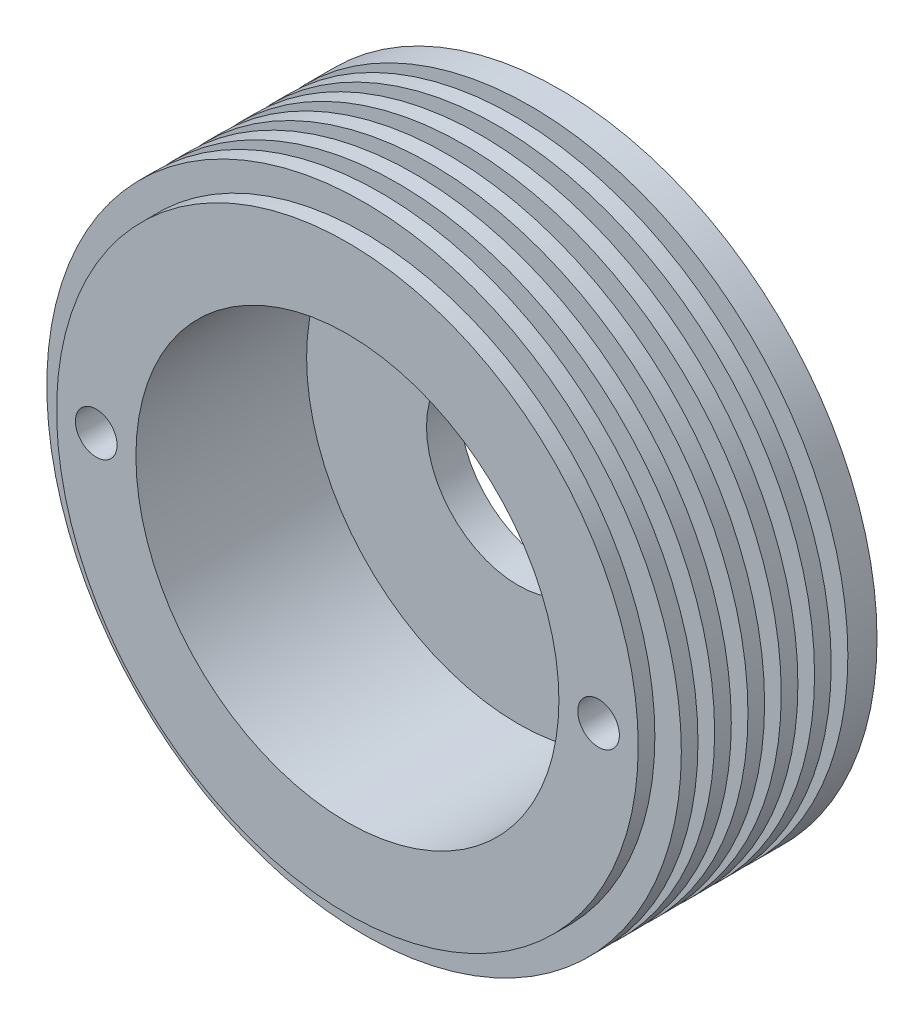
ISO-10303-21;
HEADER;
FILE_DESCRIPTION(('STEP AP214'),'2;1');
FILE_NAME('part.step','',(''),(''),'','','');
FILE_SCHEMA(('AUTOMOTIVE_DESIGN { 1 0 10303 214 1 1 1 1 }'));
ENDSEC;
DATA;
#1=APPLICATION_CONTEXT('core data for automotive mechanical design processes');
#2=APPLICATION_PROTOCOL_DEFINITION('international standard','automotive_design',2000,#1);
#3=PRODUCT_CONTEXT('',#1,'mechanical');
#4=PRODUCT('Part','Part','',(#3));
#5=PRODUCT_RELATED_PRODUCT_CATEGORY('part','',(#4));
#6=PRODUCT_DEFINITION_FORMATION('','',#4);
#7=PRODUCT_DEFINITION_CONTEXT('part definition',#1,'design');
#8=PRODUCT_DEFINITION('design','',#6,#7);
#9=PRODUCT_DEFINITION_SHAPE('','',#8);
#10=(LENGTH_UNIT() NAMED_UNIT(*) SI_UNIT(.MILLI.,.METRE.));
#11=(NAMED_UNIT(*) PLANE_ANGLE_UNIT() SI_UNIT($,.RADIAN.));
#12=(NAMED_UNIT(*) SI_UNIT($,.STERADIAN.) SOLID_ANGLE_UNIT());
#13=UNCERTAINTY_MEASURE_WITH_UNIT(LENGTH_MEASURE(1.E-05),#10,'distance_accuracy_value','');
#14=(GEOMETRIC_REPRESENTATION_CONTEXT(3) GLOBAL_UNCERTAINTY_ASSIGNED_CONTEXT((#13)) GLOBAL_UNIT_ASSIGNED_CONTEXT((#10,
#11,#12)) REPRESENTATION_CONTEXT('',''));
#15=CARTESIAN_POINT('',(0.,0.,0.));
#16=DIRECTION('',(0.,0.,1.));
#17=DIRECTION('',(1.,0.,0.));
#18=AXIS2_PLACEMENT_3D('',#15,#16,#17);
#19=CARTESIAN_POINT('',(23.6795038759268,29.6707036517637,25.5));
#20=DIRECTION('',(0.,0.,-1.));
#21=DIRECTION('',(-1.,0.,0.));
#22=AXIS2_PLACEMENT_3D('',#19,#20,#21);
#23=CYLINDRICAL_SURFACE('',#22,38.1);
#24=CARTESIAN_POINT('',(23.6795038759268,29.6707036517637,0.));
#25=DIRECTION('',(0.,0.,1.));
#26=DIRECTION('',(1.,0.,0.));
#27=AXIS2_PLACEMENT_3D('',#24,#25,#26);
#28=CIRCLE('',#27,38.1);
#29=CARTESIAN_POINT('',(61.7795038759268,29.6707036517637,0.));
#30=VERTEX_POINT('',#29);
#31=EDGE_CURVE('E11',#30,#30,#28,.T.);
#32=ORIENTED_EDGE('',*,*,#31,.T.);
#33=EDGE_LOOP('',(#32));
#34=FACE_BOUND('',#33,.T.);
#35=CARTESIAN_POINT('',(23.6795038759268,29.6707036517637,3.5));
#36=DIRECTION('',(0.,0.,1.));
#37=DIRECTION('',(1.,0.,0.));
#38=AXIS2_PLACEMENT_3D('',#35,#36,#37);
#39=CIRCLE('',#38,38.1);
#40=CARTESIAN_POINT('',(61.7795038759268,29.6707036517637,3.5));
#41=VERTEX_POINT('',#40);
#42=EDGE_CURVE('E88',#41,#41,#39,.T.);
#43=ORIENTED_EDGE('',*,*,#42,.F.);
#44=EDGE_LOOP('',(#43));
#45=FACE_BOUND('',#44,.T.);
#46=ADVANCED_FACE('F39',(#34,#45),#23,.T.);
#47=CARTESIAN_POINT('',(23.6795038759268,29.6707036517637,21.5));
#48=DIRECTION('',(0.,0.,1.));
#49=DIRECTION('',(1.,0.,0.));
#50=AXIS2_PLACEMENT_3D('',#47,#48,#49);
#51=CIRCLE('',#50,38.1);
#52=CARTESIAN_POINT('',(61.7795038759268,29.6707036517637,21.5));
#53=VERTEX_POINT('',#52);
#54=EDGE_CURVE('E150',#53,#53,#51,.T.);
#55=ORIENTED_EDGE('',*,*,#54,.T.);
#56=EDGE_LOOP('',(#55));
#57=FACE_BOUND('',#56,.T.);
#58=CARTESIAN_POINT('',(23.6795038759268,29.6707036517637,23.5));
#59=DIRECTION('',(0.,0.,1.));
#60=DIRECTION('',(1.,0.,0.));
#61=AXIS2_PLACEMENT_3D('',#58,#59,#60);
#62=CIRCLE('',#61,38.1);
#63=CARTESIAN_POINT('',(61.7795038759268,29.6707036517637,23.5));
#64=VERTEX_POINT('',#63);
#65=EDGE_CURVE('E68',#64,#64,#62,.T.);
#66=ORIENTED_EDGE('',*,*,#65,.F.);
#67=EDGE_LOOP('',(#66));
#68=FACE_BOUND('',#67,.T.);
#69=ADVANCED_FACE('F41',(#57,#68),#23,.T.);
#70=CARTESIAN_POINT('',(23.6795038759268,29.6707036517637,25.5));
#71=DIRECTION('',(0.,0.,1.));
#72=DIRECTION('',(1.,0.,0.));
#73=AXIS2_PLACEMENT_3D('',#70,#71,#72);
#74=PLANE('',#73);
#75=CARTESIAN_POINT('',(-6.48299612407322,29.6707036517637,25.5));
#76=DIRECTION('',(0.,0.,-1.));
#77=DIRECTION('',(-1.,0.,0.));
#78=AXIS2_PLACEMENT_3D('',#75,#76,#77);
#79=CIRCLE('',#78,2.5);
#80=CARTESIAN_POINT('',(-8.98299612407322,29.6707036517637,25.5));
#81=VERTEX_POINT('',#80);
#82=EDGE_CURVE('E98',#81,#81,#79,.T.);
#83=ORIENTED_EDGE('',*,*,#82,.T.);
#84=EDGE_LOOP('',(#83));
#85=FACE_BOUND('',#84,.T.);
#86=CARTESIAN_POINT('',(53.8420038759268,29.6707036517639,25.5));
#87=DIRECTION('',(0.,0.,-1.));
#88=DIRECTION('',(-1.,0.,0.));
#89=AXIS2_PLACEMENT_3D('',#86,#87,#88);
#90=CIRCLE('',#89,2.5);
#91=CARTESIAN_POINT('',(51.3420038759268,29.6707036517639,25.5));
#92=VERTEX_POINT('',#91);
#93=EDGE_CURVE('E168',#92,#92,#90,.T.);
#94=ORIENTED_EDGE('',*,*,#93,.T.);
#95=EDGE_LOOP('',(#94));
#96=FACE_BOUND('',#95,.T.);
#97=CARTESIAN_POINT('',(23.6795038759268,29.6707036517637,25.5));
#98=DIRECTION('',(0.,0.,1.));
#99=DIRECTION('',(1.,0.,0.));
#100=AXIS2_PLACEMENT_3D('',#97,#98,#99);
#101=CIRCLE('',#100,25.4);
#102=CARTESIAN_POINT('',(49.0795038759268,29.6707036517637,25.5));
#103=VERTEX_POINT('',#102);
#104=EDGE_CURVE('E53',#103,#103,#101,.T.);
#105=ORIENTED_EDGE('',*,*,#104,.F.);
#106=EDGE_LOOP('',(#105));
#107=FACE_BOUND('',#106,.T.);
#108=CARTESIAN_POINT('',(23.6795038759268,29.6707036517637,25.5));
#109=DIRECTION('',(0.,0.,1.));
#110=DIRECTION('',(1.,0.,0.));
#111=AXIS2_PLACEMENT_3D('',#108,#109,#110);
#112=CIRCLE('',#111,34.925);
#113=CARTESIAN_POINT('',(58.6045038759268,29.6707036517637,25.5));
#114=VERTEX_POINT('',#113);
#115=EDGE_CURVE('E76',#114,#114,#112,.T.);
#116=ORIENTED_EDGE('',*,*,#115,.T.);
#117=EDGE_LOOP('',(#116));
#118=FACE_BOUND('',#117,.T.);
#119=ADVANCED_FACE('F180',(#85,#96,#107,#118),#74,.T.);
#120=CARTESIAN_POINT('',(23.6795038759268,29.6707036517637,36.1126983722081));
#121=DIRECTION('',(0.,0.,-1.));
#122=DIRECTION('',(-1.,0.,0.));
#123=AXIS2_PLACEMENT_3D('',#120,#121,#122);
#124=CYLINDRICAL_SURFACE('',#123,11.);
#125=CARTESIAN_POINT('',(23.6795038759268,29.6707036517637,5.));
#126=DIRECTION('',(0.,0.,1.));
#127=DIRECTION('',(1.,0.,0.));
#128=AXIS2_PLACEMENT_3D('',#125,#126,#127);
#129=CIRCLE('',#128,11.);
#130=CARTESIAN_POINT('',(34.6795038759268,29.6707036517637,5.));
#131=VERTEX_POINT('',#130);
#132=EDGE_CURVE('E59',#131,#131,#129,.F.);
#133=ORIENTED_EDGE('',*,*,#132,.F.);
#134=EDGE_LOOP('',(#133));
#135=FACE_BOUND('',#134,.T.);
#136=CARTESIAN_POINT('',(23.6795038759268,29.6707036517637,1.));
#137=DIRECTION('',(0.,0.,-1.));
#138=DIRECTION('',(-1.,0.,0.));
#139=AXIS2_PLACEMENT_3D('',#136,#137,#138);
#140=CIRCLE('',#139,11.);
#141=CARTESIAN_POINT('',(12.6795038759268,29.6707036517637,1.));
#142=VERTEX_POINT('',#141);
#143=EDGE_CURVE('E43',#142,#142,#140,.F.);
#144=ORIENTED_EDGE('',*,*,#143,.F.);
#145=EDGE_LOOP('',(#144));
#146=FACE_BOUND('',#145,.T.);
#147=ADVANCED_FACE('F194',(#135,#146),#124,.F.);
#148=CARTESIAN_POINT('',(23.6795038759268,29.6707036517637,0.));
#149=DIRECTION('',(0.,0.,1.));
#150=DIRECTION('',(1.,0.,0.));
#151=AXIS2_PLACEMENT_3D('',#148,#149,#150);
#152=PLANE('',#151);
#153=CARTESIAN_POINT('',(-6.48299612407322,29.6707036517637,0.));
#154=DIRECTION('',(0.,0.,-1.));
#155=DIRECTION('',(-1.,0.,0.));
#156=AXIS2_PLACEMENT_3D('',#153,#154,#155);
#157=CIRCLE('',#156,2.5);
#158=CARTESIAN_POINT('',(-8.98299612407322,29.6707036517637,0.));
#159=VERTEX_POINT('',#158);
#160=EDGE_CURVE('E172',#159,#159,#157,.T.);
#161=ORIENTED_EDGE('',*,*,#160,.F.);
#162=EDGE_LOOP('',(#161));
#163=FACE_BOUND('',#162,.T.);
#164=CARTESIAN_POINT('',(53.8420038759268,29.6707036517639,0.));
#165=DIRECTION('',(0.,0.,-1.));
#166=DIRECTION('',(-1.,0.,0.));
#167=AXIS2_PLACEMENT_3D('',#164,#165,#166);
#168=CIRCLE('',#167,2.5);
#169=CARTESIAN_POINT('',(51.3420038759268,29.6707036517639,0.));
#170=VERTEX_POINT('',#169);
#171=EDGE_CURVE('E164',#170,#170,#168,.T.);
#172=ORIENTED_EDGE('',*,*,#171,.F.);
#173=EDGE_LOOP('',(#172));
#174=FACE_BOUND('',#173,.T.);
#175=CARTESIAN_POINT('',(23.6795038759268,29.6707036517637,0.));
#176=DIRECTION('',(0.,0.,-1.));
#177=DIRECTION('',(-1.,0.,0.));
#178=AXIS2_PLACEMENT_3D('',#175,#176,#177);
#179=CIRCLE('',#178,12.7);
#180=CARTESIAN_POINT('',(10.9795038759268,29.6707036517637,0.));
#181=VERTEX_POINT('',#180);
#182=EDGE_CURVE('E63',#181,#181,#179,.T.);
#183=ORIENTED_EDGE('',*,*,#182,.F.);
#184=EDGE_LOOP('',(#183));
#185=FACE_BOUND('',#184,.T.);
#186=ORIENTED_EDGE('',*,*,#31,.F.);
#187=EDGE_LOOP('',(#186));
#188=FACE_BOUND('',#187,.T.);
#189=ADVANCED_FACE('F190',(#163,#174,#185,#188),#152,.F.);
#190=CARTESIAN_POINT('',(23.6795038759268,29.6707036517637,-71.8420489685532));
#191=DIRECTION('',(0.,0.,1.));
#192=DIRECTION('',(1.,0.,0.));
#193=AXIS2_PLACEMENT_3D('',#190,#191,#192);
#194=CYLINDRICAL_SURFACE('',#193,25.4);
#195=CARTESIAN_POINT('',(23.6795038759268,29.6707036517637,5.));
#196=DIRECTION('',(0.,0.,1.));
#197=DIRECTION('',(1.,0.,0.));
#198=AXIS2_PLACEMENT_3D('',#195,#196,#197);
#199=CIRCLE('',#198,25.4);
#200=CARTESIAN_POINT('',(49.0795038759268,29.6707036517637,5.));
#201=VERTEX_POINT('',#200);
#202=EDGE_CURVE('E48',#201,#201,#199,.F.);
#203=ORIENTED_EDGE('',*,*,#202,.T.);
#204=EDGE_LOOP('',(#203));
#205=FACE_BOUND('',#204,.T.);
#206=ORIENTED_EDGE('',*,*,#104,.T.);
#207=EDGE_LOOP('',(#206));
#208=FACE_BOUND('',#207,.T.);
#209=ADVANCED_FACE('F193',(#205,#208),#194,.F.);
#210=CARTESIAN_POINT('',(23.6795038759268,29.6707036517637,5.));
#211=DIRECTION('',(0.,0.,1.));
#212=DIRECTION('',(1.,0.,0.));
#213=AXIS2_PLACEMENT_3D('',#210,#211,#212);
#214=PLANE('',#213);
#215=ORIENTED_EDGE('',*,*,#132,.T.);
#216=EDGE_LOOP('',(#215));
#217=FACE_BOUND('',#216,.T.);
#218=ORIENTED_EDGE('',*,*,#202,.F.);
#219=EDGE_LOOP('',(#218));
#220=FACE_BOUND('',#219,.T.);
#221=ADVANCED_FACE('F213',(#217,#220),#214,.T.);
#222=CARTESIAN_POINT('',(23.6795038759268,29.6707036517637,1.));
#223=DIRECTION('',(0.,0.,-1.));
#224=DIRECTION('',(-1.,0.,0.));
#225=AXIS2_PLACEMENT_3D('',#222,#223,#224);
#226=PLANE('',#225);
#227=CARTESIAN_POINT('',(23.6795038759268,29.6707036517637,1.));
#228=DIRECTION('',(0.,0.,-1.));
#229=DIRECTION('',(-1.,0.,0.));
#230=AXIS2_PLACEMENT_3D('',#227,#228,#229);
#231=CIRCLE('',#230,12.7);
#232=CARTESIAN_POINT('',(10.9795038759268,29.6707036517637,1.));
#233=VERTEX_POINT('',#232);
#234=EDGE_CURVE('E67',#233,#233,#231,.T.);
#235=ORIENTED_EDGE('',*,*,#234,.T.);
#236=EDGE_LOOP('',(#235));
#237=FACE_BOUND('',#236,.T.);
#238=ORIENTED_EDGE('',*,*,#143,.T.);
#239=EDGE_LOOP('',(#238));
#240=FACE_BOUND('',#239,.T.);
#241=ADVANCED_FACE('F203',(#237,#240),#226,.T.);
#242=CARTESIAN_POINT('',(23.6795038759268,29.6707036517637,1.));
#243=DIRECTION('',(0.,0.,-1.));
#244=DIRECTION('',(-1.,0.,0.));
#245=AXIS2_PLACEMENT_3D('',#242,#243,#244);
#246=CYLINDRICAL_SURFACE('',#245,12.7);
#247=ORIENTED_EDGE('',*,*,#234,.F.);
#248=EDGE_LOOP('',(#247));
#249=FACE_BOUND('',#248,.T.);
#250=ORIENTED_EDGE('',*,*,#182,.T.);
#251=EDGE_LOOP('',(#250));
#252=FACE_BOUND('',#251,.T.);
#253=ADVANCED_FACE('F200',(#249,#252),#246,.F.);
#254=CARTESIAN_POINT('',(23.6795038759268,29.6707036517637,23.5));
#255=DIRECTION('',(0.,0.,1.));
#256=DIRECTION('',(1.,0.,0.));
#257=AXIS2_PLACEMENT_3D('',#254,#255,#256);
#258=PLANE('',#257);
#259=CARTESIAN_POINT('',(23.6795038759268,29.6707036517637,23.5));
#260=DIRECTION('',(0.,0.,1.));
#261=DIRECTION('',(1.,0.,0.));
#262=AXIS2_PLACEMENT_3D('',#259,#260,#261);
#263=CIRCLE('',#262,34.925);
#264=CARTESIAN_POINT('',(58.6045038759268,29.6707036517637,23.5));
#265=VERTEX_POINT('',#264);
#266=EDGE_CURVE('E75',#265,#265,#263,.T.);
#267=ORIENTED_EDGE('',*,*,#266,.F.);
#268=EDGE_LOOP('',(#267));
#269=FACE_BOUND('',#268,.T.);
#270=ORIENTED_EDGE('',*,*,#65,.T.);
#271=EDGE_LOOP('',(#270));
#272=FACE_BOUND('',#271,.T.);
#273=ADVANCED_FACE('F202',(#269,#272),#258,.T.);
#274=CARTESIAN_POINT('',(23.6795038759268,29.6707036517637,23.5));
#275=DIRECTION('',(0.,0.,1.));
#276=DIRECTION('',(1.,0.,0.));
#277=AXIS2_PLACEMENT_3D('',#274,#275,#276);
#278=CYLINDRICAL_SURFACE('',#277,34.925);
#279=ORIENTED_EDGE('',*,*,#266,.T.);
#280=EDGE_LOOP('',(#279));
#281=FACE_BOUND('',#280,.T.);
#282=ORIENTED_EDGE('',*,*,#115,.F.);
#283=EDGE_LOOP('',(#282));
#284=FACE_BOUND('',#283,.T.);
#285=ADVANCED_FACE('F210',(#281,#284),#278,.T.);
#286=CARTESIAN_POINT('',(23.6795038759268,29.6707036517637,3.5));
#287=DIRECTION('',(0.,0.,1.));
#288=DIRECTION('',(1.,0.,0.));
#289=AXIS2_PLACEMENT_3D('',#286,#287,#288);
#290=PLANE('',#289);
#291=CARTESIAN_POINT('',(23.6795038759268,29.6707036517637,3.5));
#292=DIRECTION('',(0.,0.,1.));
#293=DIRECTION('',(1.,0.,0.));
#294=AXIS2_PLACEMENT_3D('',#291,#292,#293);
#295=CIRCLE('',#294,34.925);
#296=CARTESIAN_POINT('',(58.6045038759268,29.6707036517637,3.5));
#297=VERTEX_POINT('',#296);
#298=EDGE_CURVE('E89',#297,#297,#295,.T.);
#299=ORIENTED_EDGE('',*,*,#298,.F.);
#300=EDGE_LOOP('',(#299));
#301=FACE_BOUND('',#300,.T.);
#302=ORIENTED_EDGE('',*,*,#42,.T.);
#303=EDGE_LOOP('',(#302));
#304=FACE_BOUND('',#303,.T.);
#305=ADVANCED_FACE('F286',(#301,#304),#290,.T.);
#306=CARTESIAN_POINT('',(23.6795038759268,29.6707036517637,5.5));
#307=DIRECTION('',(0.,0.,1.));
#308=DIRECTION('',(1.,0.,0.));
#309=AXIS2_PLACEMENT_3D('',#306,#307,#308);
#310=PLANE('',#309);
#311=CARTESIAN_POINT('',(23.6795038759268,29.6707036517637,5.5));
#312=DIRECTION('',(0.,0.,1.));
#313=DIRECTION('',(1.,0.,0.));
#314=AXIS2_PLACEMENT_3D('',#311,#312,#313);
#315=CIRCLE('',#314,34.925);
#316=CARTESIAN_POINT('',(58.6045038759268,29.6707036517637,5.5));
#317=VERTEX_POINT('',#316);
#318=EDGE_CURVE('E94',#317,#317,#315,.T.);
#319=ORIENTED_EDGE('',*,*,#318,.T.);
#320=EDGE_LOOP('',(#319));
#321=FACE_BOUND('',#320,.T.);
#322=CARTESIAN_POINT('',(23.6795038759268,29.6707036517637,5.5));
#323=DIRECTION('',(0.,0.,1.));
#324=DIRECTION('',(1.,0.,0.));
#325=AXIS2_PLACEMENT_3D('',#322,#323,#324);
#326=CIRCLE('',#325,38.1);
#327=CARTESIAN_POINT('',(61.7795038759268,29.6707036517637,5.5));
#328=VERTEX_POINT('',#327);
#329=EDGE_CURVE('E84',#328,#328,#326,.T.);
#330=ORIENTED_EDGE('',*,*,#329,.F.);
#331=EDGE_LOOP('',(#330));
#332=FACE_BOUND('',#331,.T.);
#333=ADVANCED_FACE('F284',(#321,#332),#310,.F.);
#334=CARTESIAN_POINT('',(23.6795038759268,29.6707036517637,3.5));
#335=DIRECTION('',(0.,0.,1.));
#336=DIRECTION('',(1.,0.,0.));
#337=AXIS2_PLACEMENT_3D('',#334,#335,#336);
#338=CYLINDRICAL_SURFACE('',#337,34.925);
#339=ORIENTED_EDGE('',*,*,#298,.T.);
#340=EDGE_LOOP('',(#339));
#341=FACE_BOUND('',#340,.T.);
#342=ORIENTED_EDGE('',*,*,#318,.F.);
#343=EDGE_LOOP('',(#342));
#344=FACE_BOUND('',#343,.T.);
#345=ADVANCED_FACE('F280',(#341,#344),#338,.T.);
#346=CARTESIAN_POINT('',(23.6795038759268,29.6707036517637,19.5));
#347=DIRECTION('',(0.,0.,1.));
#348=DIRECTION('',(1.,0.,0.));
#349=AXIS2_PLACEMENT_3D('',#346,#347,#348);
#350=PLANE('',#349);
#351=CARTESIAN_POINT('',(23.6795038759268,29.6707036517637,19.5));
#352=DIRECTION('',(0.,0.,1.));
#353=DIRECTION('',(1.,0.,0.));
#354=AXIS2_PLACEMENT_3D('',#351,#352,#353);
#355=CIRCLE('',#354,34.925);
#356=CARTESIAN_POINT('',(58.6045038759268,29.6707036517637,19.5));
#357=VERTEX_POINT('',#356);
#358=EDGE_CURVE('E154',#357,#357,#355,.T.);
#359=ORIENTED_EDGE('',*,*,#358,.F.);
#360=EDGE_LOOP('',(#359));
#361=FACE_BOUND('',#360,.T.);
#362=CARTESIAN_POINT('',(23.6795038759268,29.6707036517637,19.5));
#363=DIRECTION('',(0.,0.,1.));
#364=DIRECTION('',(1.,0.,0.));
#365=AXIS2_PLACEMENT_3D('',#362,#363,#364);
#366=CIRCLE('',#365,38.1);
#367=CARTESIAN_POINT('',(61.7795038759268,29.6707036517637,19.5));
#368=VERTEX_POINT('',#367);
#369=EDGE_CURVE('E80',#368,#368,#366,.T.);
#370=ORIENTED_EDGE('',*,*,#369,.T.);
#371=EDGE_LOOP('',(#370));
#372=FACE_BOUND('',#371,.T.);
#373=ADVANCED_FACE('F283',(#361,#372),#350,.T.);
#374=CARTESIAN_POINT('',(23.6795038759268,29.6707036517637,21.5));
#375=DIRECTION('',(0.,0.,1.));
#376=DIRECTION('',(1.,0.,0.));
#377=AXIS2_PLACEMENT_3D('',#374,#375,#376);
#378=PLANE('',#377);
#379=CARTESIAN_POINT('',(23.6795038759268,29.6707036517637,21.5));
#380=DIRECTION('',(0.,0.,1.));
#381=DIRECTION('',(1.,0.,0.));
#382=AXIS2_PLACEMENT_3D('',#379,#380,#381);
#383=CIRCLE('',#382,34.925);
#384=CARTESIAN_POINT('',(58.6045038759268,29.6707036517637,21.5));
#385=VERTEX_POINT('',#384);
#386=EDGE_CURVE('E143',#385,#385,#383,.T.);
#387=ORIENTED_EDGE('',*,*,#386,.T.);
#388=EDGE_LOOP('',(#387));
#389=FACE_BOUND('',#388,.T.);
#390=ORIENTED_EDGE('',*,*,#54,.F.);
#391=EDGE_LOOP('',(#390));
#392=FACE_BOUND('',#391,.T.);
#393=ADVANCED_FACE('F238',(#389,#392),#378,.F.);
#394=CARTESIAN_POINT('',(23.6795038759268,29.6707036517637,19.5));
#395=DIRECTION('',(0.,0.,1.));
#396=DIRECTION('',(1.,0.,0.));
#397=AXIS2_PLACEMENT_3D('',#394,#395,#396);
#398=CYLINDRICAL_SURFACE('',#397,34.925);
#399=ORIENTED_EDGE('',*,*,#358,.T.);
#400=EDGE_LOOP('',(#399));
#401=FACE_BOUND('',#400,.T.);
#402=ORIENTED_EDGE('',*,*,#386,.F.);
#403=EDGE_LOOP('',(#402));
#404=FACE_BOUND('',#403,.T.);
#405=ADVANCED_FACE('F228',(#401,#404),#398,.T.);
#406=ORIENTED_EDGE('',*,*,#329,.T.);
#407=EDGE_LOOP('',(#406));
#408=FACE_BOUND('',#407,.T.);
#409=CARTESIAN_POINT('',(23.6795038759268,29.6707036517637,7.5));
#410=DIRECTION('',(0.,0.,1.));
#411=DIRECTION('',(1.,0.,0.));
#412=AXIS2_PLACEMENT_3D('',#409,#410,#411);
#413=CIRCLE('',#412,38.1);
#414=CARTESIAN_POINT('',(61.7795038759268,29.6707036517637,7.5));
#415=VERTEX_POINT('',#414);
#416=EDGE_CURVE('E106',#415,#415,#413,.T.);
#417=ORIENTED_EDGE('',*,*,#416,.F.);
#418=EDGE_LOOP('',(#417));
#419=FACE_BOUND('',#418,.T.);
#420=ADVANCED_FACE('F219',(#408,#419),#23,.T.);
#421=CARTESIAN_POINT('',(23.6795038759268,29.6707036517637,7.5));
#422=DIRECTION('',(0.,0.,1.));
#423=DIRECTION('',(1.,0.,0.));
#424=AXIS2_PLACEMENT_3D('',#421,#422,#423);
#425=PLANE('',#424);
#426=CARTESIAN_POINT('',(23.6795038759268,29.6707036517637,7.5));
#427=DIRECTION('',(0.,0.,1.));
#428=DIRECTION('',(1.,0.,0.));
#429=AXIS2_PLACEMENT_3D('',#426,#427,#428);
#430=CIRCLE('',#429,34.925);
#431=CARTESIAN_POINT('',(58.6045038759268,29.6707036517637,7.5));
#432=VERTEX_POINT('',#431);
#433=EDGE_CURVE('E107',#432,#432,#430,.T.);
#434=ORIENTED_EDGE('',*,*,#433,.F.);
#435=EDGE_LOOP('',(#434));
#436=FACE_BOUND('',#435,.T.);
#437=ORIENTED_EDGE('',*,*,#416,.T.);
#438=EDGE_LOOP('',(#437));
#439=FACE_BOUND('',#438,.T.);
#440=ADVANCED_FACE('F227',(#436,#439),#425,.T.);
#441=CARTESIAN_POINT('',(23.6795038759268,29.6707036517637,9.5));
#442=DIRECTION('',(0.,0.,1.));
#443=DIRECTION('',(1.,0.,0.));
#444=AXIS2_PLACEMENT_3D('',#441,#442,#443);
#445=PLANE('',#444);
#446=CARTESIAN_POINT('',(23.6795038759268,29.6707036517637,9.5));
#447=DIRECTION('',(0.,0.,1.));
#448=DIRECTION('',(1.,0.,0.));
#449=AXIS2_PLACEMENT_3D('',#446,#447,#448);
#450=CIRCLE('',#449,34.925);
#451=CARTESIAN_POINT('',(58.6045038759268,29.6707036517637,9.5));
#452=VERTEX_POINT('',#451);
#453=EDGE_CURVE('E93',#452,#452,#450,.T.);
#454=ORIENTED_EDGE('',*,*,#453,.T.);
#455=EDGE_LOOP('',(#454));
#456=FACE_BOUND('',#455,.T.);
#457=CARTESIAN_POINT('',(23.6795038759268,29.6707036517637,9.5));
#458=DIRECTION('',(0.,0.,1.));
#459=DIRECTION('',(1.,0.,0.));
#460=AXIS2_PLACEMENT_3D('',#457,#458,#459);
#461=CIRCLE('',#460,38.1);
#462=CARTESIAN_POINT('',(61.7795038759268,29.6707036517637,9.5));
#463=VERTEX_POINT('',#462);
#464=EDGE_CURVE('E102',#463,#463,#461,.T.);
#465=ORIENTED_EDGE('',*,*,#464,.F.);
#466=EDGE_LOOP('',(#465));
#467=FACE_BOUND('',#466,.T.);
#468=ADVANCED_FACE('F235',(#456,#467),#445,.F.);
#469=CARTESIAN_POINT('',(23.6795038759268,29.6707036517637,7.5));
#470=DIRECTION('',(0.,0.,1.));
#471=DIRECTION('',(1.,0.,0.));
#472=AXIS2_PLACEMENT_3D('',#469,#470,#471);
#473=CYLINDRICAL_SURFACE('',#472,34.925);
#474=ORIENTED_EDGE('',*,*,#433,.T.);
#475=EDGE_LOOP('',(#474));
#476=FACE_BOUND('',#475,.T.);
#477=ORIENTED_EDGE('',*,*,#453,.F.);
#478=EDGE_LOOP('',(#477));
#479=FACE_BOUND('',#478,.T.);
#480=ADVANCED_FACE('F273',(#476,#479),#473,.T.);
#481=CARTESIAN_POINT('',(23.6795038759268,29.6707036517637,17.5));
#482=DIRECTION('',(0.,0.,1.));
#483=DIRECTION('',(1.,0.,0.));
#484=AXIS2_PLACEMENT_3D('',#481,#482,#483);
#485=CIRCLE('',#484,38.1);
#486=CARTESIAN_POINT('',(61.7795038759268,29.6707036517637,17.5));
#487=VERTEX_POINT('',#486);
#488=EDGE_CURVE('E134',#487,#487,#485,.T.);
#489=ORIENTED_EDGE('',*,*,#488,.T.);
#490=EDGE_LOOP('',(#489));
#491=FACE_BOUND('',#490,.T.);
#492=ORIENTED_EDGE('',*,*,#369,.F.);
#493=EDGE_LOOP('',(#492));
#494=FACE_BOUND('',#493,.T.);
#495=ADVANCED_FACE('F224',(#491,#494),#23,.T.);
#496=CARTESIAN_POINT('',(23.6795038759268,29.6707036517637,15.5));
#497=DIRECTION('',(0.,0.,1.));
#498=DIRECTION('',(1.,0.,0.));
#499=AXIS2_PLACEMENT_3D('',#496,#497,#498);
#500=PLANE('',#499);
#501=CARTESIAN_POINT('',(23.6795038759268,29.6707036517637,15.5));
#502=DIRECTION('',(0.,0.,1.));
#503=DIRECTION('',(1.,0.,0.));
#504=AXIS2_PLACEMENT_3D('',#501,#502,#503);
#505=CIRCLE('',#504,34.925);
#506=CARTESIAN_POINT('',(58.6045038759268,29.6707036517637,15.5));
#507=VERTEX_POINT('',#506);
#508=EDGE_CURVE('E139',#507,#507,#505,.T.);
#509=ORIENTED_EDGE('',*,*,#508,.F.);
#510=EDGE_LOOP('',(#509));
#511=FACE_BOUND('',#510,.T.);
#512=CARTESIAN_POINT('',(23.6795038759268,29.6707036517637,15.5));
#513=DIRECTION('',(0.,0.,1.));
#514=DIRECTION('',(1.,0.,0.));
#515=AXIS2_PLACEMENT_3D('',#512,#513,#514);
#516=CIRCLE('',#515,38.1);
#517=CARTESIAN_POINT('',(61.7795038759268,29.6707036517637,15.5));
#518=VERTEX_POINT('',#517);
#519=EDGE_CURVE('E138',#518,#518,#516,.T.);
#520=ORIENTED_EDGE('',*,*,#519,.T.);
#521=EDGE_LOOP('',(#520));
#522=FACE_BOUND('',#521,.T.);
#523=ADVANCED_FACE('F435',(#511,#522),#500,.T.);
#524=CARTESIAN_POINT('',(23.6795038759268,29.6707036517637,17.5));
#525=DIRECTION('',(0.,0.,1.));
#526=DIRECTION('',(1.,0.,0.));
#527=AXIS2_PLACEMENT_3D('',#524,#525,#526);
#528=PLANE('',#527);
#529=CARTESIAN_POINT('',(23.6795038759268,29.6707036517637,17.5));
#530=DIRECTION('',(0.,0.,1.));
#531=DIRECTION('',(1.,0.,0.));
#532=AXIS2_PLACEMENT_3D('',#529,#530,#531);
#533=CIRCLE('',#532,34.925);
#534=CARTESIAN_POINT('',(58.6045038759268,29.6707036517637,17.5));
#535=VERTEX_POINT('',#534);
#536=EDGE_CURVE('E127',#535,#535,#533,.T.);
#537=ORIENTED_EDGE('',*,*,#536,.T.);
#538=EDGE_LOOP('',(#537));
#539=FACE_BOUND('',#538,.T.);
#540=ORIENTED_EDGE('',*,*,#488,.F.);
#541=EDGE_LOOP('',(#540));
#542=FACE_BOUND('',#541,.T.);
#543=ADVANCED_FACE('F252',(#539,#542),#528,.F.);
#544=CARTESIAN_POINT('',(23.6795038759268,29.6707036517637,15.5));
#545=DIRECTION('',(0.,0.,1.));
#546=DIRECTION('',(1.,0.,0.));
#547=AXIS2_PLACEMENT_3D('',#544,#545,#546);
#548=CYLINDRICAL_SURFACE('',#547,34.925);
#549=ORIENTED_EDGE('',*,*,#508,.T.);
#550=EDGE_LOOP('',(#549));
#551=FACE_BOUND('',#550,.T.);
#552=ORIENTED_EDGE('',*,*,#536,.F.);
#553=EDGE_LOOP('',(#552));
#554=FACE_BOUND('',#553,.T.);
#555=ADVANCED_FACE('F244',(#551,#554),#548,.T.);
#556=ORIENTED_EDGE('',*,*,#464,.T.);
#557=EDGE_LOOP('',(#556));
#558=FACE_BOUND('',#557,.T.);
#559=CARTESIAN_POINT('',(23.6795038759268,29.6707036517637,11.5));
#560=DIRECTION('',(0.,0.,1.));
#561=DIRECTION('',(1.,0.,0.));
#562=AXIS2_PLACEMENT_3D('',#559,#560,#561);
#563=CIRCLE('',#562,38.1);
#564=CARTESIAN_POINT('',(61.7795038759268,29.6707036517637,11.5));
#565=VERTEX_POINT('',#564);
#566=EDGE_CURVE('E122',#565,#565,#563,.T.);
#567=ORIENTED_EDGE('',*,*,#566,.F.);
#568=EDGE_LOOP('',(#567));
#569=FACE_BOUND('',#568,.T.);
#570=ADVANCED_FACE('F230',(#558,#569),#23,.T.);
#571=CARTESIAN_POINT('',(23.6795038759268,29.6707036517637,13.5));
#572=DIRECTION('',(0.,0.,1.));
#573=DIRECTION('',(1.,0.,0.));
#574=AXIS2_PLACEMENT_3D('',#571,#572,#573);
#575=CIRCLE('',#574,38.1);
#576=CARTESIAN_POINT('',(61.7795038759268,29.6707036517637,13.5));
#577=VERTEX_POINT('',#576);
#578=EDGE_CURVE('E118',#577,#577,#575,.T.);
#579=ORIENTED_EDGE('',*,*,#578,.T.);
#580=EDGE_LOOP('',(#579));
#581=FACE_BOUND('',#580,.T.);
#582=ORIENTED_EDGE('',*,*,#519,.F.);
#583=EDGE_LOOP('',(#582));
#584=FACE_BOUND('',#583,.T.);
#585=ADVANCED_FACE('F243',(#581,#584),#23,.T.);
#586=CARTESIAN_POINT('',(23.6795038759268,29.6707036517637,11.5));
#587=DIRECTION('',(0.,0.,1.));
#588=DIRECTION('',(1.,0.,0.));
#589=AXIS2_PLACEMENT_3D('',#586,#587,#588);
#590=PLANE('',#589);
#591=CARTESIAN_POINT('',(23.6795038759268,29.6707036517637,11.5));
#592=DIRECTION('',(0.,0.,1.));
#593=DIRECTION('',(1.,0.,0.));
#594=AXIS2_PLACEMENT_3D('',#591,#592,#593);
#595=CIRCLE('',#594,34.925);
#596=CARTESIAN_POINT('',(58.6045038759268,29.6707036517637,11.5));
#597=VERTEX_POINT('',#596);
#598=EDGE_CURVE('E123',#597,#597,#595,.T.);
#599=ORIENTED_EDGE('',*,*,#598,.F.);
#600=EDGE_LOOP('',(#599));
#601=FACE_BOUND('',#600,.T.);
#602=ORIENTED_EDGE('',*,*,#566,.T.);
#603=EDGE_LOOP('',(#602));
#604=FACE_BOUND('',#603,.T.);
#605=ADVANCED_FACE('F250',(#601,#604),#590,.T.);
#606=CARTESIAN_POINT('',(23.6795038759268,29.6707036517637,13.5));
#607=DIRECTION('',(0.,0.,1.));
#608=DIRECTION('',(1.,0.,0.));
#609=AXIS2_PLACEMENT_3D('',#606,#607,#608);
#610=PLANE('',#609);
#611=CARTESIAN_POINT('',(23.6795038759268,29.6707036517637,13.5));
#612=DIRECTION('',(0.,0.,1.));
#613=DIRECTION('',(1.,0.,0.));
#614=AXIS2_PLACEMENT_3D('',#611,#612,#613);
#615=CIRCLE('',#614,34.925);
#616=CARTESIAN_POINT('',(58.6045038759268,29.6707036517637,13.5));
#617=VERTEX_POINT('',#616);
#618=EDGE_CURVE('E111',#617,#617,#615,.T.);
#619=ORIENTED_EDGE('',*,*,#618,.T.);
#620=EDGE_LOOP('',(#619));
#621=FACE_BOUND('',#620,.T.);
#622=ORIENTED_EDGE('',*,*,#578,.F.);
#623=EDGE_LOOP('',(#622));
#624=FACE_BOUND('',#623,.T.);
#625=ADVANCED_FACE('F260',(#621,#624),#610,.F.);
#626=CARTESIAN_POINT('',(23.6795038759268,29.6707036517637,11.5));
#627=DIRECTION('',(0.,0.,1.));
#628=DIRECTION('',(1.,0.,0.));
#629=AXIS2_PLACEMENT_3D('',#626,#627,#628);
#630=CYLINDRICAL_SURFACE('',#629,34.925);
#631=ORIENTED_EDGE('',*,*,#598,.T.);
#632=EDGE_LOOP('',(#631));
#633=FACE_BOUND('',#632,.T.);
#634=ORIENTED_EDGE('',*,*,#618,.F.);
#635=EDGE_LOOP('',(#634));
#636=FACE_BOUND('',#635,.T.);
#637=ADVANCED_FACE('F266',(#633,#636),#630,.T.);
#638=CARTESIAN_POINT('',(53.8420038759268,29.6707036517639,25.5));
#639=DIRECTION('',(0.,0.,-1.));
#640=DIRECTION('',(-1.,0.,0.));
#641=AXIS2_PLACEMENT_3D('',#638,#639,#640);
#642=CYLINDRICAL_SURFACE('',#641,2.5);
#643=ORIENTED_EDGE('',*,*,#93,.F.);
#644=EDGE_LOOP('',(#643));
#645=FACE_BOUND('',#644,.T.);
#646=ORIENTED_EDGE('',*,*,#171,.T.);
#647=EDGE_LOOP('',(#646));
#648=FACE_BOUND('',#647,.T.);
#649=ADVANCED_FACE('F186',(#645,#648),#642,.F.);
#650=CARTESIAN_POINT('',(-6.48299612407322,29.6707036517637,25.5));
#651=DIRECTION('',(0.,0.,-1.));
#652=DIRECTION('',(-1.,0.,0.));
#653=AXIS2_PLACEMENT_3D('',#650,#651,#652);
#654=CYLINDRICAL_SURFACE('',#653,2.5);
#655=ORIENTED_EDGE('',*,*,#82,.F.);
#656=EDGE_LOOP('',(#655));
#657=FACE_BOUND('',#656,.T.);
#658=ORIENTED_EDGE('',*,*,#160,.T.);
#659=EDGE_LOOP('',(#658));
#660=FACE_BOUND('',#659,.T.);
#661=ADVANCED_FACE('F183',(#657,#660),#654,.F.);
#662=CLOSED_SHELL('',(#46,#69,#119,#147,#189,#209,#221,#241,#253,#273,#285,#305,#333,#345,#373,
#393,#405,#420,#440,#468,#480,#495,#523,#543,#555,#570,#585,#605,#625,#637,#649,#661));
#663=MANIFOLD_SOLID_BREP('B2',#662);
#664=ADVANCED_BREP_SHAPE_REPRESENTATION('',(#18,#663),#14);
#665=SHAPE_DEFINITION_REPRESENTATION(#9,#664);
ENDSEC;
END-ISO-10303-21;
